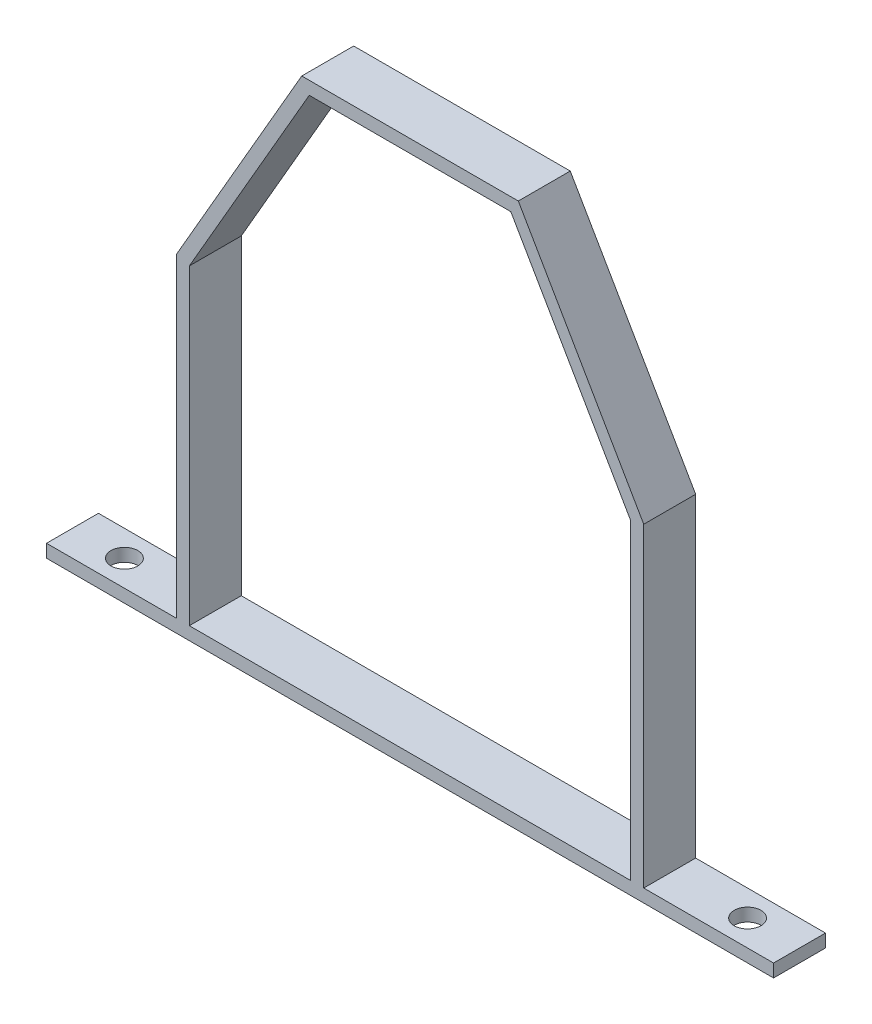
ISO-10303-21;
HEADER;
FILE_DESCRIPTION(('STEP AP214'),'2;1');
FILE_NAME('part.step','',(''),(''),'','','');
FILE_SCHEMA(('AUTOMOTIVE_DESIGN { 1 0 10303 214 1 1 1 1 }'));
ENDSEC;
DATA;
#1=APPLICATION_CONTEXT('core data for automotive mechanical design processes');
#2=APPLICATION_PROTOCOL_DEFINITION('international standard','automotive_design',2000,#1);
#3=PRODUCT_CONTEXT('',#1,'mechanical');
#4=PRODUCT('Part','Part','',(#3));
#5=PRODUCT_RELATED_PRODUCT_CATEGORY('part','',(#4));
#6=PRODUCT_DEFINITION_FORMATION('','',#4);
#7=PRODUCT_DEFINITION_CONTEXT('part definition',#1,'design');
#8=PRODUCT_DEFINITION('design','',#6,#7);
#9=PRODUCT_DEFINITION_SHAPE('','',#8);
#10=(LENGTH_UNIT() NAMED_UNIT(*) SI_UNIT(.MILLI.,.METRE.));
#11=(NAMED_UNIT(*) PLANE_ANGLE_UNIT() SI_UNIT($,.RADIAN.));
#12=(NAMED_UNIT(*) SI_UNIT($,.STERADIAN.) SOLID_ANGLE_UNIT());
#13=UNCERTAINTY_MEASURE_WITH_UNIT(LENGTH_MEASURE(1.E-05),#10,'distance_accuracy_value','');
#14=(GEOMETRIC_REPRESENTATION_CONTEXT(3) GLOBAL_UNCERTAINTY_ASSIGNED_CONTEXT((#13)) GLOBAL_UNIT_ASSIGNED_CONTEXT((#10,
#11,#12)) REPRESENTATION_CONTEXT('',''));
#15=CARTESIAN_POINT('',(0.,0.,0.));
#16=DIRECTION('',(0.,0.,1.));
#17=DIRECTION('',(1.,0.,0.));
#18=AXIS2_PLACEMENT_3D('',#15,#16,#17);
#19=CARTESIAN_POINT('',(0.,0.,25.4));
#20=DIRECTION('',(0.,0.,-1.));
#21=DIRECTION('',(-1.,0.,0.));
#22=AXIS2_PLACEMENT_3D('',#19,#20,#21);
#23=PLANE('',#22);
#24=DIRECTION('',(0.,1.,0.));
#25=VECTOR('',#24,1.);
#26=CARTESIAN_POINT('',(0.,6.35,25.4));
#27=LINE('',#26,#25);
#28=CARTESIAN_POINT('',(0.,0.,25.4));
#29=VERTEX_POINT('',#28);
#30=CARTESIAN_POINT('',(0.,6.35,25.4));
#31=VERTEX_POINT('',#30);
#32=EDGE_CURVE('E226',#29,#31,#27,.T.);
#33=ORIENTED_EDGE('',*,*,#32,.T.);
#34=DIRECTION('',(-1.,0.,0.));
#35=VECTOR('',#34,1.);
#36=CARTESIAN_POINT('',(-63.5,6.34999999999999,25.4));
#37=LINE('',#36,#35);
#38=CARTESIAN_POINT('',(-63.5,6.34999999999999,25.4));
#39=VERTEX_POINT('',#38);
#40=EDGE_CURVE('E230',#31,#39,#37,.T.);
#41=ORIENTED_EDGE('',*,*,#40,.T.);
#42=DIRECTION('',(0.,1.,0.));
#43=VECTOR('',#42,1.);
#44=CARTESIAN_POINT('',(-63.5,160.451477371938,25.4));
#45=LINE('',#44,#43);
#46=CARTESIAN_POINT('',(-63.5,160.451477371938,25.4));
#47=VERTEX_POINT('',#46);
#48=EDGE_CURVE('E234',#39,#47,#45,.T.);
#49=ORIENTED_EDGE('',*,*,#48,.T.);
#50=DIRECTION('',(-0.500000000000001,0.866025403784438,0.));
#51=VECTOR('',#50,1.);
#52=CARTESIAN_POINT('',(-124.842613140312,266.7,25.4));
#53=LINE('',#52,#51);
#54=CARTESIAN_POINT('',(-124.842613140312,266.7,25.4));
#55=VERTEX_POINT('',#54);
#56=EDGE_CURVE('E237',#47,#55,#53,.T.);
#57=ORIENTED_EDGE('',*,*,#56,.T.);
#58=DIRECTION('',(-1.,0.,0.));
#59=VECTOR('',#58,1.);
#60=CARTESIAN_POINT('',(-230.757386859688,266.7,25.4));
#61=LINE('',#60,#59);
#62=CARTESIAN_POINT('',(-230.757386859688,266.7,25.4));
#63=VERTEX_POINT('',#62);
#64=EDGE_CURVE('E240',#55,#63,#61,.T.);
#65=ORIENTED_EDGE('',*,*,#64,.T.);
#66=DIRECTION('',(-0.500000000000001,-0.866025403784438,0.));
#67=VECTOR('',#66,1.);
#68=CARTESIAN_POINT('',(-292.1,160.451477371938,25.4));
#69=LINE('',#68,#67);
#70=CARTESIAN_POINT('',(-292.1,160.451477371938,25.4));
#71=VERTEX_POINT('',#70);
#72=EDGE_CURVE('E243',#63,#71,#69,.T.);
#73=ORIENTED_EDGE('',*,*,#72,.T.);
#74=DIRECTION('',(0.,-1.,0.));
#75=VECTOR('',#74,1.);
#76=CARTESIAN_POINT('',(-292.1,6.35,25.4));
#77=LINE('',#76,#75);
#78=CARTESIAN_POINT('',(-292.1,6.35,25.4));
#79=VERTEX_POINT('',#78);
#80=EDGE_CURVE('E246',#71,#79,#77,.T.);
#81=ORIENTED_EDGE('',*,*,#80,.T.);
#82=DIRECTION('',(-1.,0.,0.));
#83=VECTOR('',#82,1.);
#84=CARTESIAN_POINT('',(-355.6,6.35,25.4));
#85=LINE('',#84,#83);
#86=CARTESIAN_POINT('',(-355.6,6.35,25.4));
#87=VERTEX_POINT('',#86);
#88=EDGE_CURVE('E249',#79,#87,#85,.T.);
#89=ORIENTED_EDGE('',*,*,#88,.T.);
#90=DIRECTION('',(0.,-1.,0.));
#91=VECTOR('',#90,1.);
#92=CARTESIAN_POINT('',(-355.6,0.,25.4));
#93=LINE('',#92,#91);
#94=CARTESIAN_POINT('',(-355.6,0.,25.4));
#95=VERTEX_POINT('',#94);
#96=EDGE_CURVE('E252',#87,#95,#93,.T.);
#97=ORIENTED_EDGE('',*,*,#96,.T.);
#98=DIRECTION('',(1.,0.,0.));
#99=VECTOR('',#98,1.);
#100=CARTESIAN_POINT('',(0.,0.,25.4));
#101=LINE('',#100,#99);
#102=EDGE_CURVE('E255',#95,#29,#101,.T.);
#103=ORIENTED_EDGE('',*,*,#102,.T.);
#104=EDGE_LOOP('',(#33,#41,#49,#57,#65,#73,#81,#89,#97,#103));
#105=FACE_BOUND('',#104,.T.);
#106=DIRECTION('',(-0.500000000000001,-0.866025403784438,0.));
#107=VECTOR('',#106,1.);
#108=CARTESIAN_POINT('',(-227.091212650334,260.35,25.4));
#109=LINE('',#108,#107);
#110=CARTESIAN_POINT('',(-227.091212650334,260.35,25.4));
#111=VERTEX_POINT('',#110);
#112=CARTESIAN_POINT('',(-285.75,158.75,25.4));
#113=VERTEX_POINT('',#112);
#114=EDGE_CURVE('E155',#111,#113,#109,.T.);
#115=ORIENTED_EDGE('',*,*,#114,.F.);
#116=DIRECTION('',(-1.,0.,0.));
#117=VECTOR('',#116,1.);
#118=CARTESIAN_POINT('',(-128.508787349666,260.35,25.4));
#119=LINE('',#118,#117);
#120=CARTESIAN_POINT('',(-128.508787349666,260.35,25.4));
#121=VERTEX_POINT('',#120);
#122=EDGE_CURVE('E191',#121,#111,#119,.T.);
#123=ORIENTED_EDGE('',*,*,#122,.F.);
#124=DIRECTION('',(-0.500000000000001,0.866025403784438,0.));
#125=VECTOR('',#124,1.);
#126=CARTESIAN_POINT('',(-69.8500000000001,158.75,25.4));
#127=LINE('',#126,#125);
#128=CARTESIAN_POINT('',(-69.8500000000001,158.75,25.4));
#129=VERTEX_POINT('',#128);
#130=EDGE_CURVE('E188',#129,#121,#127,.T.);
#131=ORIENTED_EDGE('',*,*,#130,.F.);
#132=DIRECTION('',(0.,1.,0.));
#133=VECTOR('',#132,1.);
#134=CARTESIAN_POINT('',(-69.85,6.35000000000002,25.4));
#135=LINE('',#134,#133);
#136=CARTESIAN_POINT('',(-69.85,6.35000000000002,25.4));
#137=VERTEX_POINT('',#136);
#138=EDGE_CURVE('E182',#137,#129,#135,.T.);
#139=ORIENTED_EDGE('',*,*,#138,.F.);
#140=DIRECTION('',(1.,0.,0.));
#141=VECTOR('',#140,1.);
#142=CARTESIAN_POINT('',(-285.75,6.35,25.4));
#143=LINE('',#142,#141);
#144=CARTESIAN_POINT('',(-285.75,6.35,25.4));
#145=VERTEX_POINT('',#144);
#146=EDGE_CURVE('E178',#145,#137,#143,.T.);
#147=ORIENTED_EDGE('',*,*,#146,.F.);
#148=DIRECTION('',(0.,-1.,0.));
#149=VECTOR('',#148,1.);
#150=CARTESIAN_POINT('',(-285.75,158.75,25.4));
#151=LINE('',#150,#149);
#152=EDGE_CURVE('E164',#113,#145,#151,.T.);
#153=ORIENTED_EDGE('',*,*,#152,.F.);
#154=EDGE_LOOP('',(#115,#123,#131,#139,#147,#153));
#155=FACE_BOUND('',#154,.T.);
#156=ADVANCED_FACE('F41',(#105,#155),#23,.F.);
#157=CARTESIAN_POINT('',(0.,0.,0.));
#158=DIRECTION('',(0.,0.,-1.));
#159=DIRECTION('',(-1.,0.,0.));
#160=AXIS2_PLACEMENT_3D('',#157,#158,#159);
#161=PLANE('',#160);
#162=DIRECTION('',(0.,1.,0.));
#163=VECTOR('',#162,1.);
#164=CARTESIAN_POINT('',(0.,6.35,0.));
#165=LINE('',#164,#163);
#166=CARTESIAN_POINT('',(0.,0.,0.));
#167=VERTEX_POINT('',#166);
#168=CARTESIAN_POINT('',(0.,6.35,0.));
#169=VERTEX_POINT('',#168);
#170=EDGE_CURVE('E173',#167,#169,#165,.T.);
#171=ORIENTED_EDGE('',*,*,#170,.F.);
#172=DIRECTION('',(1.,0.,0.));
#173=VECTOR('',#172,1.);
#174=CARTESIAN_POINT('',(0.,0.,0.));
#175=LINE('',#174,#173);
#176=CARTESIAN_POINT('',(-355.6,0.,0.));
#177=VERTEX_POINT('',#176);
#178=EDGE_CURVE('E231',#177,#167,#175,.T.);
#179=ORIENTED_EDGE('',*,*,#178,.F.);
#180=DIRECTION('',(0.,-1.,0.));
#181=VECTOR('',#180,1.);
#182=CARTESIAN_POINT('',(-355.6,0.,0.));
#183=LINE('',#182,#181);
#184=CARTESIAN_POINT('',(-355.6,6.35,0.));
#185=VERTEX_POINT('',#184);
#186=EDGE_CURVE('E283',#185,#177,#183,.T.);
#187=ORIENTED_EDGE('',*,*,#186,.F.);
#188=DIRECTION('',(-1.,0.,0.));
#189=VECTOR('',#188,1.);
#190=CARTESIAN_POINT('',(-355.6,6.35,0.));
#191=LINE('',#190,#189);
#192=CARTESIAN_POINT('',(-292.1,6.35,0.));
#193=VERTEX_POINT('',#192);
#194=EDGE_CURVE('E280',#193,#185,#191,.T.);
#195=ORIENTED_EDGE('',*,*,#194,.F.);
#196=DIRECTION('',(0.,-1.,0.));
#197=VECTOR('',#196,1.);
#198=CARTESIAN_POINT('',(-292.1,6.35,0.));
#199=LINE('',#198,#197);
#200=CARTESIAN_POINT('',(-292.1,160.451477371938,0.));
#201=VERTEX_POINT('',#200);
#202=EDGE_CURVE('E277',#201,#193,#199,.T.);
#203=ORIENTED_EDGE('',*,*,#202,.F.);
#204=DIRECTION('',(-0.500000000000001,-0.866025403784438,0.));
#205=VECTOR('',#204,1.);
#206=CARTESIAN_POINT('',(-292.1,160.451477371938,0.));
#207=LINE('',#206,#205);
#208=CARTESIAN_POINT('',(-230.757386859688,266.7,0.));
#209=VERTEX_POINT('',#208);
#210=EDGE_CURVE('E274',#209,#201,#207,.T.);
#211=ORIENTED_EDGE('',*,*,#210,.F.);
#212=DIRECTION('',(-1.,0.,0.));
#213=VECTOR('',#212,1.);
#214=CARTESIAN_POINT('',(-230.757386859688,266.7,0.));
#215=LINE('',#214,#213);
#216=CARTESIAN_POINT('',(-124.842613140312,266.7,0.));
#217=VERTEX_POINT('',#216);
#218=EDGE_CURVE('E271',#217,#209,#215,.T.);
#219=ORIENTED_EDGE('',*,*,#218,.F.);
#220=DIRECTION('',(-0.500000000000001,0.866025403784438,0.));
#221=VECTOR('',#220,1.);
#222=CARTESIAN_POINT('',(-124.842613140312,266.7,0.));
#223=LINE('',#222,#221);
#224=CARTESIAN_POINT('',(-63.5,160.451477371938,0.));
#225=VERTEX_POINT('',#224);
#226=EDGE_CURVE('E268',#225,#217,#223,.T.);
#227=ORIENTED_EDGE('',*,*,#226,.F.);
#228=DIRECTION('',(0.,1.,0.));
#229=VECTOR('',#228,1.);
#230=CARTESIAN_POINT('',(-63.5,160.451477371938,0.));
#231=LINE('',#230,#229);
#232=CARTESIAN_POINT('',(-63.5,6.34999999999999,0.));
#233=VERTEX_POINT('',#232);
#234=EDGE_CURVE('E265',#233,#225,#231,.T.);
#235=ORIENTED_EDGE('',*,*,#234,.F.);
#236=DIRECTION('',(-1.,0.,0.));
#237=VECTOR('',#236,1.);
#238=CARTESIAN_POINT('',(-63.5,6.34999999999999,0.));
#239=LINE('',#238,#237);
#240=EDGE_CURVE('E262',#169,#233,#239,.T.);
#241=ORIENTED_EDGE('',*,*,#240,.F.);
#242=EDGE_LOOP('',(#171,#179,#187,#195,#203,#211,#219,#227,#235,#241));
#243=FACE_BOUND('',#242,.T.);
#244=DIRECTION('',(-1.,0.,0.));
#245=VECTOR('',#244,1.);
#246=CARTESIAN_POINT('',(-128.508787349666,260.35,0.));
#247=LINE('',#246,#245);
#248=CARTESIAN_POINT('',(-128.508787349666,260.35,0.));
#249=VERTEX_POINT('',#248);
#250=CARTESIAN_POINT('',(-227.091212650334,260.35,0.));
#251=VERTEX_POINT('',#250);
#252=EDGE_CURVE('E165',#249,#251,#247,.T.);
#253=ORIENTED_EDGE('',*,*,#252,.T.);
#254=DIRECTION('',(-0.500000000000001,-0.866025403784438,0.));
#255=VECTOR('',#254,1.);
#256=CARTESIAN_POINT('',(-227.091212650334,260.35,0.));
#257=LINE('',#256,#255);
#258=CARTESIAN_POINT('',(-285.75,158.75,0.));
#259=VERTEX_POINT('',#258);
#260=EDGE_CURVE('E65',#251,#259,#257,.T.);
#261=ORIENTED_EDGE('',*,*,#260,.T.);
#262=DIRECTION('',(0.,-1.,0.));
#263=VECTOR('',#262,1.);
#264=CARTESIAN_POINT('',(-285.75,158.75,0.));
#265=LINE('',#264,#263);
#266=CARTESIAN_POINT('',(-285.75,6.35,0.));
#267=VERTEX_POINT('',#266);
#268=EDGE_CURVE('E171',#259,#267,#265,.T.);
#269=ORIENTED_EDGE('',*,*,#268,.T.);
#270=DIRECTION('',(1.,0.,0.));
#271=VECTOR('',#270,1.);
#272=CARTESIAN_POINT('',(-285.75,6.35,0.));
#273=LINE('',#272,#271);
#274=CARTESIAN_POINT('',(-69.85,6.35000000000002,0.));
#275=VERTEX_POINT('',#274);
#276=EDGE_CURVE('E199',#267,#275,#273,.T.);
#277=ORIENTED_EDGE('',*,*,#276,.T.);
#278=DIRECTION('',(0.,1.,0.));
#279=VECTOR('',#278,1.);
#280=CARTESIAN_POINT('',(-69.85,6.35000000000002,0.));
#281=LINE('',#280,#279);
#282=CARTESIAN_POINT('',(-69.8500000000001,158.75,0.));
#283=VERTEX_POINT('',#282);
#284=EDGE_CURVE('E203',#275,#283,#281,.T.);
#285=ORIENTED_EDGE('',*,*,#284,.T.);
#286=DIRECTION('',(-0.500000000000001,0.866025403784438,0.));
#287=VECTOR('',#286,1.);
#288=CARTESIAN_POINT('',(-69.8500000000001,158.75,0.));
#289=LINE('',#288,#287);
#290=EDGE_CURVE('E207',#283,#249,#289,.T.);
#291=ORIENTED_EDGE('',*,*,#290,.T.);
#292=EDGE_LOOP('',(#253,#261,#269,#277,#285,#291));
#293=FACE_BOUND('',#292,.T.);
#294=ADVANCED_FACE('F330',(#243,#293),#161,.T.);
#295=CARTESIAN_POINT('',(0.,6.35,25.4));
#296=DIRECTION('',(-1.,0.,0.));
#297=DIRECTION('',(0.,0.,1.));
#298=AXIS2_PLACEMENT_3D('',#295,#296,#297);
#299=PLANE('',#298);
#300=ORIENTED_EDGE('',*,*,#170,.T.);
#301=DIRECTION('',(0.,0.,-1.));
#302=VECTOR('',#301,1.);
#303=CARTESIAN_POINT('',(0.,6.35,25.4));
#304=LINE('',#303,#302);
#305=EDGE_CURVE('E11',#31,#169,#304,.T.);
#306=ORIENTED_EDGE('',*,*,#305,.F.);
#307=ORIENTED_EDGE('',*,*,#32,.F.);
#308=DIRECTION('',(0.,0.,-1.));
#309=VECTOR('',#308,1.);
#310=CARTESIAN_POINT('',(0.,0.,25.4));
#311=LINE('',#310,#309);
#312=EDGE_CURVE('E258',#29,#167,#311,.T.);
#313=ORIENTED_EDGE('',*,*,#312,.T.);
#314=EDGE_LOOP('',(#300,#306,#307,#313));
#315=FACE_BOUND('',#314,.T.);
#316=ADVANCED_FACE('F43',(#315),#299,.F.);
#317=CARTESIAN_POINT('',(-63.5,6.34999999999999,25.4));
#318=DIRECTION('',(0.,-1.,0.));
#319=DIRECTION('',(1.,0.,0.));
#320=AXIS2_PLACEMENT_3D('',#317,#318,#319);
#321=PLANE('',#320);
#322=CARTESIAN_POINT('',(-25.4,6.35,12.7));
#323=DIRECTION('',(0.,-1.,0.));
#324=DIRECTION('',(1.,0.,0.));
#325=AXIS2_PLACEMENT_3D('',#322,#323,#324);
#326=CIRCLE('',#325,6.54811999999998);
#327=CARTESIAN_POINT('',(-18.85188,6.35,12.7));
#328=VERTEX_POINT('',#327);
#329=EDGE_CURVE('E404',#328,#328,#326,.T.);
#330=ORIENTED_EDGE('',*,*,#329,.T.);
#331=EDGE_LOOP('',(#330));
#332=FACE_BOUND('',#331,.T.);
#333=ORIENTED_EDGE('',*,*,#240,.T.);
#334=DIRECTION('',(0.,0.,-1.));
#335=VECTOR('',#334,1.);
#336=CARTESIAN_POINT('',(-63.5,6.34999999999999,25.4));
#337=LINE('',#336,#335);
#338=EDGE_CURVE('E50',#39,#233,#337,.T.);
#339=ORIENTED_EDGE('',*,*,#338,.F.);
#340=ORIENTED_EDGE('',*,*,#40,.F.);
#341=ORIENTED_EDGE('',*,*,#305,.T.);
#342=EDGE_LOOP('',(#333,#339,#340,#341));
#343=FACE_BOUND('',#342,.T.);
#344=ADVANCED_FACE('F347',(#332,#343),#321,.F.);
#345=CARTESIAN_POINT('',(-63.5,160.451477371938,25.4));
#346=DIRECTION('',(-1.,0.,0.));
#347=DIRECTION('',(0.,-1.,0.));
#348=AXIS2_PLACEMENT_3D('',#345,#346,#347);
#349=PLANE('',#348);
#350=ORIENTED_EDGE('',*,*,#234,.T.);
#351=DIRECTION('',(0.,0.,-1.));
#352=VECTOR('',#351,1.);
#353=CARTESIAN_POINT('',(-63.5,160.451477371938,25.4));
#354=LINE('',#353,#352);
#355=EDGE_CURVE('E315',#47,#225,#354,.T.);
#356=ORIENTED_EDGE('',*,*,#355,.F.);
#357=ORIENTED_EDGE('',*,*,#48,.F.);
#358=ORIENTED_EDGE('',*,*,#338,.T.);
#359=EDGE_LOOP('',(#350,#356,#357,#358));
#360=FACE_BOUND('',#359,.T.);
#361=ADVANCED_FACE('F324',(#360),#349,.F.);
#362=CARTESIAN_POINT('',(-124.842613140312,266.7,25.4));
#363=DIRECTION('',(-0.866025403784438,-0.500000000000001,0.));
#364=DIRECTION('',(0.500000000000001,-0.866025403784438,0.));
#365=AXIS2_PLACEMENT_3D('',#362,#363,#364);
#366=PLANE('',#365);
#367=ORIENTED_EDGE('',*,*,#226,.T.);
#368=DIRECTION('',(0.,0.,-1.));
#369=VECTOR('',#368,1.);
#370=CARTESIAN_POINT('',(-124.842613140312,266.7,25.4));
#371=LINE('',#370,#369);
#372=EDGE_CURVE('E311',#55,#217,#371,.T.);
#373=ORIENTED_EDGE('',*,*,#372,.F.);
#374=ORIENTED_EDGE('',*,*,#56,.F.);
#375=ORIENTED_EDGE('',*,*,#355,.T.);
#376=EDGE_LOOP('',(#367,#373,#374,#375));
#377=FACE_BOUND('',#376,.T.);
#378=ADVANCED_FACE('F336',(#377),#366,.F.);
#379=CARTESIAN_POINT('',(-230.757386859688,266.7,25.4));
#380=DIRECTION('',(0.,-1.,0.));
#381=DIRECTION('',(0.,0.,-1.));
#382=AXIS2_PLACEMENT_3D('',#379,#380,#381);
#383=PLANE('',#382);
#384=ORIENTED_EDGE('',*,*,#218,.T.);
#385=DIRECTION('',(0.,0.,-1.));
#386=VECTOR('',#385,1.);
#387=CARTESIAN_POINT('',(-230.757386859688,266.7,25.4));
#388=LINE('',#387,#386);
#389=EDGE_CURVE('E307',#63,#209,#388,.T.);
#390=ORIENTED_EDGE('',*,*,#389,.F.);
#391=ORIENTED_EDGE('',*,*,#64,.F.);
#392=ORIENTED_EDGE('',*,*,#372,.T.);
#393=EDGE_LOOP('',(#384,#390,#391,#392));
#394=FACE_BOUND('',#393,.T.);
#395=ADVANCED_FACE('F340',(#394),#383,.F.);
#396=CARTESIAN_POINT('',(-292.1,160.451477371938,25.4));
#397=DIRECTION('',(0.866025403784438,-0.500000000000001,0.));
#398=DIRECTION('',(0.500000000000001,0.866025403784438,0.));
#399=AXIS2_PLACEMENT_3D('',#396,#397,#398);
#400=PLANE('',#399);
#401=ORIENTED_EDGE('',*,*,#210,.T.);
#402=DIRECTION('',(0.,0.,-1.));
#403=VECTOR('',#402,1.);
#404=CARTESIAN_POINT('',(-292.1,160.451477371938,25.4));
#405=LINE('',#404,#403);
#406=EDGE_CURVE('E303',#71,#201,#405,.T.);
#407=ORIENTED_EDGE('',*,*,#406,.F.);
#408=ORIENTED_EDGE('',*,*,#72,.F.);
#409=ORIENTED_EDGE('',*,*,#389,.T.);
#410=EDGE_LOOP('',(#401,#407,#408,#409));
#411=FACE_BOUND('',#410,.T.);
#412=ADVANCED_FACE('F370',(#411),#400,.F.);
#413=CARTESIAN_POINT('',(-292.1,6.35,25.4));
#414=DIRECTION('',(1.,0.,0.));
#415=DIRECTION('',(0.,0.,-1.));
#416=AXIS2_PLACEMENT_3D('',#413,#414,#415);
#417=PLANE('',#416);
#418=ORIENTED_EDGE('',*,*,#202,.T.);
#419=DIRECTION('',(0.,0.,-1.));
#420=VECTOR('',#419,1.);
#421=CARTESIAN_POINT('',(-292.1,6.35,25.4));
#422=LINE('',#421,#420);
#423=EDGE_CURVE('E299',#79,#193,#422,.T.);
#424=ORIENTED_EDGE('',*,*,#423,.F.);
#425=ORIENTED_EDGE('',*,*,#80,.F.);
#426=ORIENTED_EDGE('',*,*,#406,.T.);
#427=EDGE_LOOP('',(#418,#424,#425,#426));
#428=FACE_BOUND('',#427,.T.);
#429=ADVANCED_FACE('F367',(#428),#417,.F.);
#430=CARTESIAN_POINT('',(-355.6,6.35,25.4));
#431=DIRECTION('',(0.,-1.,0.));
#432=DIRECTION('',(0.,0.,-1.));
#433=AXIS2_PLACEMENT_3D('',#430,#431,#432);
#434=PLANE('',#433);
#435=CARTESIAN_POINT('',(-330.2,6.35,12.7));
#436=DIRECTION('',(0.,-1.,0.));
#437=DIRECTION('',(0.,0.,-1.));
#438=AXIS2_PLACEMENT_3D('',#435,#436,#437);
#439=CIRCLE('',#438,6.54811999999999);
#440=CARTESIAN_POINT('',(-330.2,6.35,6.15188000000001));
#441=VERTEX_POINT('',#440);
#442=EDGE_CURVE('E196',#441,#441,#439,.T.);
#443=ORIENTED_EDGE('',*,*,#442,.T.);
#444=EDGE_LOOP('',(#443));
#445=FACE_BOUND('',#444,.T.);
#446=ORIENTED_EDGE('',*,*,#194,.T.);
#447=DIRECTION('',(0.,0.,-1.));
#448=VECTOR('',#447,1.);
#449=CARTESIAN_POINT('',(-355.6,6.35,25.4));
#450=LINE('',#449,#448);
#451=EDGE_CURVE('E295',#87,#185,#450,.T.);
#452=ORIENTED_EDGE('',*,*,#451,.F.);
#453=ORIENTED_EDGE('',*,*,#88,.F.);
#454=ORIENTED_EDGE('',*,*,#423,.T.);
#455=EDGE_LOOP('',(#446,#452,#453,#454));
#456=FACE_BOUND('',#455,.T.);
#457=ADVANCED_FACE('F363',(#445,#456),#434,.F.);
#458=CARTESIAN_POINT('',(-355.6,0.,25.4));
#459=DIRECTION('',(1.,0.,0.));
#460=DIRECTION('',(0.,0.,-1.));
#461=AXIS2_PLACEMENT_3D('',#458,#459,#460);
#462=PLANE('',#461);
#463=ORIENTED_EDGE('',*,*,#186,.T.);
#464=DIRECTION('',(0.,0.,-1.));
#465=VECTOR('',#464,1.);
#466=CARTESIAN_POINT('',(-355.6,0.,25.4));
#467=LINE('',#466,#465);
#468=EDGE_CURVE('E291',#95,#177,#467,.T.);
#469=ORIENTED_EDGE('',*,*,#468,.F.);
#470=ORIENTED_EDGE('',*,*,#96,.F.);
#471=ORIENTED_EDGE('',*,*,#451,.T.);
#472=EDGE_LOOP('',(#463,#469,#470,#471));
#473=FACE_BOUND('',#472,.T.);
#474=ADVANCED_FACE('F359',(#473),#462,.F.);
#475=CARTESIAN_POINT('',(0.,0.,25.4));
#476=DIRECTION('',(0.,1.,0.));
#477=DIRECTION('',(-1.,0.,0.));
#478=AXIS2_PLACEMENT_3D('',#475,#476,#477);
#479=PLANE('',#478);
#480=CARTESIAN_POINT('',(-25.4,0.,12.7));
#481=DIRECTION('',(0.,-1.,0.));
#482=DIRECTION('',(0.,0.,-1.));
#483=AXIS2_PLACEMENT_3D('',#480,#481,#482);
#484=CIRCLE('',#483,6.54811999999999);
#485=CARTESIAN_POINT('',(-25.4,0.,6.15188000000001));
#486=VERTEX_POINT('',#485);
#487=EDGE_CURVE('E410',#486,#486,#484,.T.);
#488=ORIENTED_EDGE('',*,*,#487,.F.);
#489=EDGE_LOOP('',(#488));
#490=FACE_BOUND('',#489,.T.);
#491=CARTESIAN_POINT('',(-330.2,0.,12.7));
#492=DIRECTION('',(0.,-1.,0.));
#493=DIRECTION('',(0.,0.,-1.));
#494=AXIS2_PLACEMENT_3D('',#491,#492,#493);
#495=CIRCLE('',#494,6.54811999999999);
#496=CARTESIAN_POINT('',(-330.2,0.,6.15188000000001));
#497=VERTEX_POINT('',#496);
#498=EDGE_CURVE('E401',#497,#497,#495,.T.);
#499=ORIENTED_EDGE('',*,*,#498,.F.);
#500=EDGE_LOOP('',(#499));
#501=FACE_BOUND('',#500,.T.);
#502=ORIENTED_EDGE('',*,*,#178,.T.);
#503=ORIENTED_EDGE('',*,*,#312,.F.);
#504=ORIENTED_EDGE('',*,*,#102,.F.);
#505=ORIENTED_EDGE('',*,*,#468,.T.);
#506=EDGE_LOOP('',(#502,#503,#504,#505));
#507=FACE_BOUND('',#506,.T.);
#508=ADVANCED_FACE('F354',(#490,#501,#507),#479,.F.);
#509=CARTESIAN_POINT('',(-227.091212650334,260.35,25.4));
#510=DIRECTION('',(0.866025403784438,-0.500000000000001,0.));
#511=DIRECTION('',(0.500000000000001,0.866025403784438,0.));
#512=AXIS2_PLACEMENT_3D('',#509,#510,#511);
#513=PLANE('',#512);
#514=ORIENTED_EDGE('',*,*,#260,.F.);
#515=DIRECTION('',(0.,0.,-1.));
#516=VECTOR('',#515,1.);
#517=CARTESIAN_POINT('',(-227.091212650334,260.35,25.4));
#518=LINE('',#517,#516);
#519=EDGE_CURVE('E159',#111,#251,#518,.T.);
#520=ORIENTED_EDGE('',*,*,#519,.F.);
#521=ORIENTED_EDGE('',*,*,#114,.T.);
#522=DIRECTION('',(0.,0.,-1.));
#523=VECTOR('',#522,1.);
#524=CARTESIAN_POINT('',(-285.75,158.75,25.4));
#525=LINE('',#524,#523);
#526=EDGE_CURVE('E158',#113,#259,#525,.T.);
#527=ORIENTED_EDGE('',*,*,#526,.T.);
#528=EDGE_LOOP('',(#514,#520,#521,#527));
#529=FACE_BOUND('',#528,.T.);
#530=ADVANCED_FACE('F157',(#529),#513,.T.);
#531=CARTESIAN_POINT('',(-285.75,158.75,25.4));
#532=DIRECTION('',(1.,0.,0.));
#533=DIRECTION('',(0.,0.,-1.));
#534=AXIS2_PLACEMENT_3D('',#531,#532,#533);
#535=PLANE('',#534);
#536=ORIENTED_EDGE('',*,*,#268,.F.);
#537=ORIENTED_EDGE('',*,*,#526,.F.);
#538=ORIENTED_EDGE('',*,*,#152,.T.);
#539=DIRECTION('',(0.,0.,-1.));
#540=VECTOR('',#539,1.);
#541=CARTESIAN_POINT('',(-285.75,6.35,25.4));
#542=LINE('',#541,#540);
#543=EDGE_CURVE('E174',#145,#267,#542,.T.);
#544=ORIENTED_EDGE('',*,*,#543,.T.);
#545=EDGE_LOOP('',(#536,#537,#538,#544));
#546=FACE_BOUND('',#545,.T.);
#547=ADVANCED_FACE('F168',(#546),#535,.T.);
#548=CARTESIAN_POINT('',(-285.75,6.35,25.4));
#549=DIRECTION('',(0.,1.,0.));
#550=DIRECTION('',(-1.,0.,0.));
#551=AXIS2_PLACEMENT_3D('',#548,#549,#550);
#552=PLANE('',#551);
#553=ORIENTED_EDGE('',*,*,#276,.F.);
#554=ORIENTED_EDGE('',*,*,#543,.F.);
#555=ORIENTED_EDGE('',*,*,#146,.T.);
#556=DIRECTION('',(0.,0.,-1.));
#557=VECTOR('',#556,1.);
#558=CARTESIAN_POINT('',(-69.85,6.35000000000002,25.4));
#559=LINE('',#558,#557);
#560=EDGE_CURVE('E221',#137,#275,#559,.T.);
#561=ORIENTED_EDGE('',*,*,#560,.T.);
#562=EDGE_LOOP('',(#553,#554,#555,#561));
#563=FACE_BOUND('',#562,.T.);
#564=ADVANCED_FACE('F438',(#563),#552,.T.);
#565=CARTESIAN_POINT('',(-69.85,6.35000000000002,25.4));
#566=DIRECTION('',(-1.,0.,0.));
#567=DIRECTION('',(0.,-1.,0.));
#568=AXIS2_PLACEMENT_3D('',#565,#566,#567);
#569=PLANE('',#568);
#570=ORIENTED_EDGE('',*,*,#284,.F.);
#571=ORIENTED_EDGE('',*,*,#560,.F.);
#572=ORIENTED_EDGE('',*,*,#138,.T.);
#573=DIRECTION('',(0.,0.,-1.));
#574=VECTOR('',#573,1.);
#575=CARTESIAN_POINT('',(-69.8500000000001,158.75,25.4));
#576=LINE('',#575,#574);
#577=EDGE_CURVE('E218',#129,#283,#576,.T.);
#578=ORIENTED_EDGE('',*,*,#577,.T.);
#579=EDGE_LOOP('',(#570,#571,#572,#578));
#580=FACE_BOUND('',#579,.T.);
#581=ADVANCED_FACE('F434',(#580),#569,.T.);
#582=CARTESIAN_POINT('',(-69.8500000000001,158.75,25.4));
#583=DIRECTION('',(-0.866025403784438,-0.500000000000001,0.));
#584=DIRECTION('',(0.500000000000001,-0.866025403784438,0.));
#585=AXIS2_PLACEMENT_3D('',#582,#583,#584);
#586=PLANE('',#585);
#587=ORIENTED_EDGE('',*,*,#290,.F.);
#588=ORIENTED_EDGE('',*,*,#577,.F.);
#589=ORIENTED_EDGE('',*,*,#130,.T.);
#590=DIRECTION('',(0.,0.,-1.));
#591=VECTOR('',#590,1.);
#592=CARTESIAN_POINT('',(-128.508787349666,260.35,25.4));
#593=LINE('',#592,#591);
#594=EDGE_CURVE('E57',#121,#249,#593,.T.);
#595=ORIENTED_EDGE('',*,*,#594,.T.);
#596=EDGE_LOOP('',(#587,#588,#589,#595));
#597=FACE_BOUND('',#596,.T.);
#598=ADVANCED_FACE('F429',(#597),#586,.T.);
#599=CARTESIAN_POINT('',(-128.508787349666,260.35,25.4));
#600=DIRECTION('',(0.,-1.,0.));
#601=DIRECTION('',(0.,0.,-1.));
#602=AXIS2_PLACEMENT_3D('',#599,#600,#601);
#603=PLANE('',#602);
#604=ORIENTED_EDGE('',*,*,#252,.F.);
#605=ORIENTED_EDGE('',*,*,#594,.F.);
#606=ORIENTED_EDGE('',*,*,#122,.T.);
#607=ORIENTED_EDGE('',*,*,#519,.T.);
#608=EDGE_LOOP('',(#604,#605,#606,#607));
#609=FACE_BOUND('',#608,.T.);
#610=ADVANCED_FACE('F422',(#609),#603,.T.);
#611=CARTESIAN_POINT('',(-330.2,0.,12.7));
#612=DIRECTION('',(0.,-1.,0.));
#613=DIRECTION('',(0.,0.,-1.));
#614=AXIS2_PLACEMENT_3D('',#611,#612,#613);
#615=CYLINDRICAL_SURFACE('',#614,6.54811999999999);
#616=ORIENTED_EDGE('',*,*,#498,.T.);
#617=EDGE_LOOP('',(#616));
#618=FACE_BOUND('',#617,.T.);
#619=ORIENTED_EDGE('',*,*,#442,.F.);
#620=EDGE_LOOP('',(#619));
#621=FACE_BOUND('',#620,.T.);
#622=ADVANCED_FACE('F420',(#618,#621),#615,.F.);
#623=CARTESIAN_POINT('',(-25.4,0.,12.7));
#624=DIRECTION('',(0.,-1.,0.));
#625=DIRECTION('',(0.,0.,-1.));
#626=AXIS2_PLACEMENT_3D('',#623,#624,#625);
#627=CYLINDRICAL_SURFACE('',#626,6.54811999999998);
#628=ORIENTED_EDGE('',*,*,#487,.T.);
#629=EDGE_LOOP('',(#628));
#630=FACE_BOUND('',#629,.T.);
#631=ORIENTED_EDGE('',*,*,#329,.F.);
#632=EDGE_LOOP('',(#631));
#633=FACE_BOUND('',#632,.T.);
#634=ADVANCED_FACE('F415',(#630,#633),#627,.F.);
#635=CLOSED_SHELL('',(#156,#294,#316,#344,#361,#378,#395,#412,#429,#457,#474,#508,#530,#547,
#564,#581,#598,#610,#622,#634));
#636=MANIFOLD_SOLID_BREP('B2',#635);
#637=ADVANCED_BREP_SHAPE_REPRESENTATION('',(#18,#636),#14);
#638=SHAPE_DEFINITION_REPRESENTATION(#9,#637);
ENDSEC;
END-ISO-10303-21;
